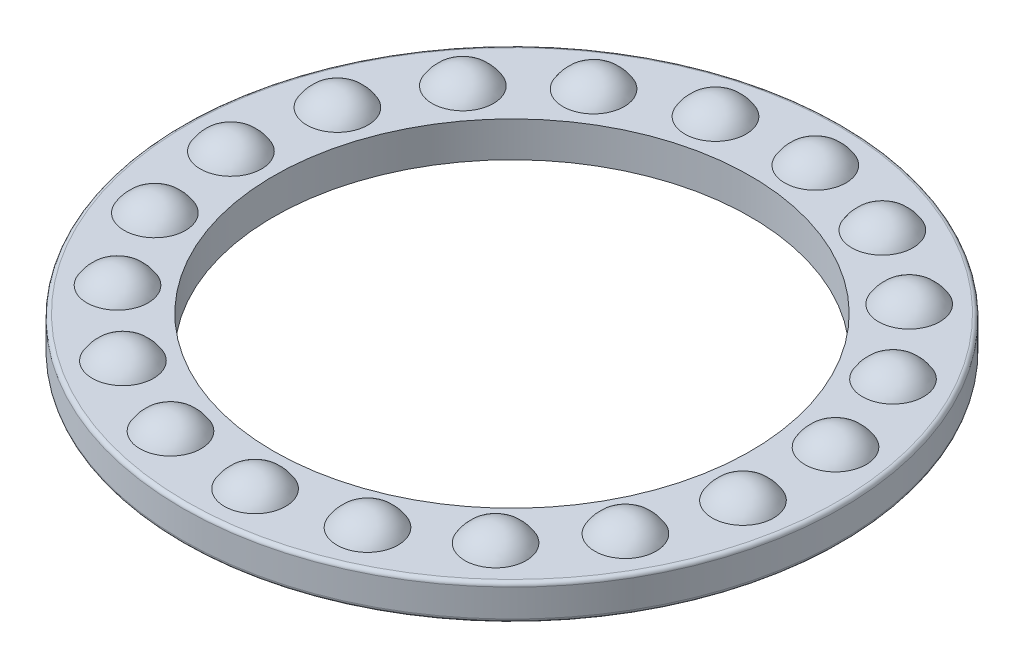
ISO-10303-21;
HEADER;
FILE_DESCRIPTION(('STEP AP214'),'2;1');
FILE_NAME('part.step','',(''),(''),'','','');
FILE_SCHEMA(('AUTOMOTIVE_DESIGN { 1 0 10303 214 1 1 1 1 }'));
ENDSEC;
DATA;
#1=APPLICATION_CONTEXT('core data for automotive mechanical design processes');
#2=APPLICATION_PROTOCOL_DEFINITION('international standard','automotive_design',2000,#1);
#3=PRODUCT_CONTEXT('',#1,'mechanical');
#4=PRODUCT('Part','Part','',(#3));
#5=PRODUCT_RELATED_PRODUCT_CATEGORY('part','',(#4));
#6=PRODUCT_DEFINITION_FORMATION('','',#4);
#7=PRODUCT_DEFINITION_CONTEXT('part definition',#1,'design');
#8=PRODUCT_DEFINITION('design','',#6,#7);
#9=PRODUCT_DEFINITION_SHAPE('','',#8);
#10=(LENGTH_UNIT() NAMED_UNIT(*) SI_UNIT(.MILLI.,.METRE.));
#11=(NAMED_UNIT(*) PLANE_ANGLE_UNIT() SI_UNIT($,.RADIAN.));
#12=(NAMED_UNIT(*) SI_UNIT($,.STERADIAN.) SOLID_ANGLE_UNIT());
#13=UNCERTAINTY_MEASURE_WITH_UNIT(LENGTH_MEASURE(1.E-05),#10,'distance_accuracy_value','');
#14=(GEOMETRIC_REPRESENTATION_CONTEXT(3) GLOBAL_UNCERTAINTY_ASSIGNED_CONTEXT((#13)) GLOBAL_UNIT_ASSIGNED_CONTEXT((#10,
#11,#12)) REPRESENTATION_CONTEXT('',''));
#15=CARTESIAN_POINT('',(0.,0.,0.));
#16=DIRECTION('',(0.,0.,1.));
#17=DIRECTION('',(1.,0.,0.));
#18=AXIS2_PLACEMENT_3D('',#15,#16,#17);
#19=CARTESIAN_POINT('',(0.,9.13,0.));
#20=DIRECTION('',(0.,1.,0.));
#21=DIRECTION('',(0.,0.,1.));
#22=AXIS2_PLACEMENT_3D('',#19,#20,#21);
#23=PLANE('',#22);
#24=CARTESIAN_POINT('',(-68.5717500232963,9.13,23.5407115173387));
#25=DIRECTION('',(0.,1.,0.));
#26=DIRECTION('',(0.,0.,1.));
#27=AXIS2_PLACEMENT_3D('',#24,#25,#26);
#28=CIRCLE('',#27,7.90681193655193);
#29=CARTESIAN_POINT('',(-68.5717500232963,9.13,31.4475234538906));
#30=VERTEX_POINT('',#29);
#31=EDGE_CURVE('E10',#30,#30,#28,.T.);
#32=ORIENTED_EDGE('',*,*,#31,.F.);
#33=EDGE_LOOP('',(#32));
#34=FACE_BOUND('',#33,.T.);
#35=CARTESIAN_POINT('',(-57.2126869312391,9.13,44.5304216700002));
#36=DIRECTION('',(0.,1.,0.));
#37=DIRECTION('',(0.,0.,1.));
#38=AXIS2_PLACEMENT_3D('',#35,#36,#37);
#39=CIRCLE('',#38,7.90681193655193);
#40=CARTESIAN_POINT('',(-57.2126869312391,9.13,52.4372336065521));
#41=VERTEX_POINT('',#40);
#42=EDGE_CURVE('E42',#41,#41,#39,.T.);
#43=ORIENTED_EDGE('',*,*,#42,.F.);
#44=EDGE_LOOP('',(#43));
#45=FACE_BOUND('',#44,.T.);
#46=CARTESIAN_POINT('',(-39.6537414638766,9.13,60.6945696740329));
#47=DIRECTION('',(0.,1.,0.));
#48=DIRECTION('',(0.,0.,1.));
#49=AXIS2_PLACEMENT_3D('',#46,#47,#48);
#50=CIRCLE('',#49,7.90681193655193);
#51=CARTESIAN_POINT('',(-39.6537414638766,9.13,68.6013816105848));
#52=VERTEX_POINT('',#51);
#53=EDGE_CURVE('E47',#52,#52,#50,.T.);
#54=ORIENTED_EDGE('',*,*,#53,.F.);
#55=EDGE_LOOP('',(#54));
#56=FACE_BOUND('',#55,.T.);
#57=CARTESIAN_POINT('',(-17.7976978177087,9.13,70.2815192806013));
#58=DIRECTION('',(0.,1.,0.));
#59=DIRECTION('',(0.,0.,1.));
#60=AXIS2_PLACEMENT_3D('',#57,#58,#59);
#61=CIRCLE('',#60,7.90681193655193);
#62=CARTESIAN_POINT('',(-17.7976978177087,9.13,78.1883312171532));
#63=VERTEX_POINT('',#62);
#64=EDGE_CURVE('E52',#63,#63,#61,.T.);
#65=ORIENTED_EDGE('',*,*,#64,.F.);
#66=EDGE_LOOP('',(#65));
#67=FACE_BOUND('',#66,.T.);
#68=CARTESIAN_POINT('',(5.98700254674342,9.13,72.2523757429836));
#69=DIRECTION('',(0.,1.,0.));
#70=DIRECTION('',(0.,0.,1.));
#71=AXIS2_PLACEMENT_3D('',#68,#69,#70);
#72=CIRCLE('',#71,7.90681193655193);
#73=CARTESIAN_POINT('',(5.98700254674342,9.13,80.1591876795355));
#74=VERTEX_POINT('',#73);
#75=EDGE_CURVE('E55',#74,#74,#72,.T.);
#76=ORIENTED_EDGE('',*,*,#75,.F.);
#77=EDGE_LOOP('',(#76));
#78=FACE_BOUND('',#77,.T.);
#79=CARTESIAN_POINT('',(29.1229182873397,9.13,66.3935661824919));
#80=DIRECTION('',(0.,1.,0.));
#81=DIRECTION('',(0.,0.,1.));
#82=AXIS2_PLACEMENT_3D('',#79,#80,#81);
#83=CIRCLE('',#82,7.90681193655193);
#84=CARTESIAN_POINT('',(29.1229182873397,9.13,74.3003781190439));
#85=VERTEX_POINT('',#84);
#86=EDGE_CURVE('E58',#85,#85,#83,.T.);
#87=ORIENTED_EDGE('',*,*,#86,.F.);
#88=EDGE_LOOP('',(#87));
#89=FACE_BOUND('',#88,.T.);
#90=CARTESIAN_POINT('',(49.1029139428658,9.13,53.3399835238025));
#91=DIRECTION('',(0.,1.,0.));
#92=DIRECTION('',(0.,0.,1.));
#93=AXIS2_PLACEMENT_3D('',#90,#91,#92);
#94=CIRCLE('',#93,7.90681193655193);
#95=CARTESIAN_POINT('',(49.1029139428658,9.13,61.2467954603544));
#96=VERTEX_POINT('',#95);
#97=EDGE_CURVE('E61',#96,#96,#94,.T.);
#98=ORIENTED_EDGE('',*,*,#97,.F.);
#99=EDGE_LOOP('',(#98));
#100=FACE_BOUND('',#99,.T.);
#101=CARTESIAN_POINT('',(63.7618469624702,9.13,34.5061859951883));
#102=DIRECTION('',(0.,1.,0.));
#103=DIRECTION('',(0.,0.,1.));
#104=AXIS2_PLACEMENT_3D('',#101,#102,#103);
#105=CIRCLE('',#104,7.90681193655193);
#106=CARTESIAN_POINT('',(63.7618469624702,9.13,42.4129979317402));
#107=VERTEX_POINT('',#106);
#108=EDGE_CURVE('E64',#107,#107,#105,.T.);
#109=ORIENTED_EDGE('',*,*,#108,.F.);
#110=EDGE_LOOP('',(#109));
#111=FACE_BOUND('',#110,.T.);
#112=CARTESIAN_POINT('',(71.5111944966973,9.13,11.9331077953537));
#113=DIRECTION('',(0.,1.,0.));
#114=DIRECTION('',(0.,0.,1.));
#115=AXIS2_PLACEMENT_3D('',#112,#113,#114);
#116=CIRCLE('',#115,7.90681193655193);
#117=CARTESIAN_POINT('',(71.5111944966973,9.13,19.8399197319056));
#118=VERTEX_POINT('',#117);
#119=EDGE_CURVE('E67',#118,#118,#116,.T.);
#120=ORIENTED_EDGE('',*,*,#119,.F.);
#121=EDGE_LOOP('',(#120));
#122=FACE_BOUND('',#121,.T.);
#123=CARTESIAN_POINT('',(71.5111944966974,9.13,-11.9331077953527));
#124=DIRECTION('',(0.,1.,0.));
#125=DIRECTION('',(0.,0.,1.));
#126=AXIS2_PLACEMENT_3D('',#123,#124,#125);
#127=CIRCLE('',#126,7.90681193655193);
#128=CARTESIAN_POINT('',(71.5111944966974,9.13,-4.02629585880081));
#129=VERTEX_POINT('',#128);
#130=EDGE_CURVE('E70',#129,#129,#127,.T.);
#131=ORIENTED_EDGE('',*,*,#130,.F.);
#132=EDGE_LOOP('',(#131));
#133=FACE_BOUND('',#132,.T.);
#134=CARTESIAN_POINT('',(63.7618469624706,9.13,-34.5061859951875));
#135=DIRECTION('',(0.,1.,0.));
#136=DIRECTION('',(0.,0.,1.));
#137=AXIS2_PLACEMENT_3D('',#134,#135,#136);
#138=CIRCLE('',#137,7.90681193655193);
#139=CARTESIAN_POINT('',(63.7618469624706,9.13,-26.5993740586356));
#140=VERTEX_POINT('',#139);
#141=EDGE_CURVE('E73',#140,#140,#138,.T.);
#142=ORIENTED_EDGE('',*,*,#141,.F.);
#143=EDGE_LOOP('',(#142));
#144=FACE_BOUND('',#143,.T.);
#145=CARTESIAN_POINT('',(49.1029139428665,9.13,-53.3399835238018));
#146=DIRECTION('',(0.,1.,0.));
#147=DIRECTION('',(0.,0.,1.));
#148=AXIS2_PLACEMENT_3D('',#145,#146,#147);
#149=CIRCLE('',#148,7.90681193655193);
#150=CARTESIAN_POINT('',(49.1029139428665,9.13,-45.4331715872499));
#151=VERTEX_POINT('',#150);
#152=EDGE_CURVE('E76',#151,#151,#149,.T.);
#153=ORIENTED_EDGE('',*,*,#152,.F.);
#154=EDGE_LOOP('',(#153));
#155=FACE_BOUND('',#154,.T.);
#156=CARTESIAN_POINT('',(29.1229182873406,9.13,-66.3935661824915));
#157=DIRECTION('',(0.,1.,0.));
#158=DIRECTION('',(0.,0.,1.));
#159=AXIS2_PLACEMENT_3D('',#156,#157,#158);
#160=CIRCLE('',#159,7.90681193655193);
#161=CARTESIAN_POINT('',(29.1229182873406,9.13,-58.4867542459396));
#162=VERTEX_POINT('',#161);
#163=EDGE_CURVE('E79',#162,#162,#160,.T.);
#164=ORIENTED_EDGE('',*,*,#163,.F.);
#165=EDGE_LOOP('',(#164));
#166=FACE_BOUND('',#165,.T.);
#167=CARTESIAN_POINT('',(5.98700254674435,9.13,-72.2523757429836));
#168=DIRECTION('',(0.,1.,0.));
#169=DIRECTION('',(0.,0.,1.));
#170=AXIS2_PLACEMENT_3D('',#167,#168,#169);
#171=CIRCLE('',#170,7.90681193655193);
#172=CARTESIAN_POINT('',(5.98700254674435,9.13,-64.3455638064316));
#173=VERTEX_POINT('',#172);
#174=EDGE_CURVE('E82',#173,#173,#171,.T.);
#175=ORIENTED_EDGE('',*,*,#174,.F.);
#176=EDGE_LOOP('',(#175));
#177=FACE_BOUND('',#176,.T.);
#178=CARTESIAN_POINT('',(-17.7976978177077,9.13,-70.2815192806015));
#179=DIRECTION('',(0.,1.,0.));
#180=DIRECTION('',(0.,0.,1.));
#181=AXIS2_PLACEMENT_3D('',#178,#179,#180);
#182=CIRCLE('',#181,7.90681193655193);
#183=CARTESIAN_POINT('',(-17.7976978177077,9.13,-62.3747073440496));
#184=VERTEX_POINT('',#183);
#185=EDGE_CURVE('E85',#184,#184,#182,.T.);
#186=ORIENTED_EDGE('',*,*,#185,.F.);
#187=EDGE_LOOP('',(#186));
#188=FACE_BOUND('',#187,.T.);
#189=CARTESIAN_POINT('',(-39.6537414638758,9.13,-60.6945696740334));
#190=DIRECTION('',(0.,1.,0.));
#191=DIRECTION('',(0.,0.,1.));
#192=AXIS2_PLACEMENT_3D('',#189,#190,#191);
#193=CIRCLE('',#192,7.90681193655193);
#194=CARTESIAN_POINT('',(-39.6537414638758,9.13,-52.7877577374815));
#195=VERTEX_POINT('',#194);
#196=EDGE_CURVE('E88',#195,#195,#193,.T.);
#197=ORIENTED_EDGE('',*,*,#196,.F.);
#198=EDGE_LOOP('',(#197));
#199=FACE_BOUND('',#198,.T.);
#200=CARTESIAN_POINT('',(-57.2126869312385,9.13,-44.530421670001));
#201=DIRECTION('',(0.,1.,0.));
#202=DIRECTION('',(0.,0.,1.));
#203=AXIS2_PLACEMENT_3D('',#200,#201,#202);
#204=CIRCLE('',#203,7.90681193655193);
#205=CARTESIAN_POINT('',(-57.2126869312385,9.13,-36.6236097334491));
#206=VERTEX_POINT('',#205);
#207=EDGE_CURVE('E91',#206,#206,#204,.T.);
#208=ORIENTED_EDGE('',*,*,#207,.F.);
#209=EDGE_LOOP('',(#208));
#210=FACE_BOUND('',#209,.T.);
#211=CARTESIAN_POINT('',(-68.571750023296,9.13,-23.5407115173396));
#212=DIRECTION('',(0.,1.,0.));
#213=DIRECTION('',(0.,0.,1.));
#214=AXIS2_PLACEMENT_3D('',#211,#212,#213);
#215=CIRCLE('',#214,7.90681193655193);
#216=CARTESIAN_POINT('',(-68.571750023296,9.13,-15.6338995807877));
#217=VERTEX_POINT('',#216);
#218=EDGE_CURVE('E94',#217,#217,#215,.T.);
#219=ORIENTED_EDGE('',*,*,#218,.F.);
#220=EDGE_LOOP('',(#219));
#221=FACE_BOUND('',#220,.T.);
#222=CARTESIAN_POINT('',(-72.5,9.13,0.));
#223=DIRECTION('',(0.,1.,0.));
#224=DIRECTION('',(0.,0.,1.));
#225=AXIS2_PLACEMENT_3D('',#222,#223,#224);
#226=CIRCLE('',#225,7.90681193655193);
#227=CARTESIAN_POINT('',(-72.5,9.13,7.90681193655193));
#228=VERTEX_POINT('',#227);
#229=EDGE_CURVE('E97',#228,#228,#226,.T.);
#230=ORIENTED_EDGE('',*,*,#229,.F.);
#231=EDGE_LOOP('',(#230));
#232=FACE_BOUND('',#231,.T.);
#233=CARTESIAN_POINT('',(0.,9.13,0.));
#234=DIRECTION('',(0.,1.,0.));
#235=DIRECTION('',(0.,0.,1.));
#236=AXIS2_PLACEMENT_3D('',#233,#234,#235);
#237=CIRCLE('',#236,84.);
#238=CARTESIAN_POINT('',(0.,9.13,84.));
#239=VERTEX_POINT('',#238);
#240=EDGE_CURVE('E100',#239,#239,#237,.T.);
#241=ORIENTED_EDGE('',*,*,#240,.T.);
#242=EDGE_LOOP('',(#241));
#243=FACE_BOUND('',#242,.T.);
#244=CARTESIAN_POINT('',(0.,9.13,0.));
#245=DIRECTION('',(0.,1.,0.));
#246=DIRECTION('',(0.,0.,1.));
#247=AXIS2_PLACEMENT_3D('',#244,#245,#246);
#248=CIRCLE('',#247,61.5);
#249=CARTESIAN_POINT('',(0.,9.13,61.5));
#250=VERTEX_POINT('',#249);
#251=EDGE_CURVE('E101',#250,#250,#248,.T.);
#252=ORIENTED_EDGE('',*,*,#251,.F.);
#253=EDGE_LOOP('',(#252));
#254=FACE_BOUND('',#253,.T.);
#255=ADVANCED_FACE('F34',(#34,#45,#56,#67,#78,#89,#100,#111,#122,#133,#144,#155,#166,#177,#188,
#199,#210,#221,#232,#243,#254),#23,.T.);
#256=CARTESIAN_POINT('',(0.,0.,0.));
#257=DIRECTION('',(0.,1.,0.));
#258=DIRECTION('',(0.,0.,1.));
#259=AXIS2_PLACEMENT_3D('',#256,#257,#258);
#260=PLANE('',#259);
#261=CARTESIAN_POINT('',(-68.5717500232963,0.,23.5407115173387));
#262=DIRECTION('',(0.,1.,0.));
#263=DIRECTION('',(0.,0.,1.));
#264=AXIS2_PLACEMENT_3D('',#261,#262,#263);
#265=CIRCLE('',#264,7.90681193655192);
#266=CARTESIAN_POINT('',(-68.5717500232963,0.,31.4475234538906));
#267=VERTEX_POINT('',#266);
#268=EDGE_CURVE('E38',#267,#267,#265,.T.);
#269=ORIENTED_EDGE('',*,*,#268,.T.);
#270=EDGE_LOOP('',(#269));
#271=FACE_BOUND('',#270,.T.);
#272=CARTESIAN_POINT('',(-57.2126869312391,0.,44.5304216700002));
#273=DIRECTION('',(0.,1.,0.));
#274=DIRECTION('',(0.,0.,1.));
#275=AXIS2_PLACEMENT_3D('',#272,#273,#274);
#276=CIRCLE('',#275,7.90681193655192);
#277=CARTESIAN_POINT('',(-57.2126869312391,0.,52.4372336065521));
#278=VERTEX_POINT('',#277);
#279=EDGE_CURVE('E168',#278,#278,#276,.T.);
#280=ORIENTED_EDGE('',*,*,#279,.T.);
#281=EDGE_LOOP('',(#280));
#282=FACE_BOUND('',#281,.T.);
#283=CARTESIAN_POINT('',(-39.6537414638766,0.,60.6945696740329));
#284=DIRECTION('',(0.,1.,0.));
#285=DIRECTION('',(0.,0.,1.));
#286=AXIS2_PLACEMENT_3D('',#283,#284,#285);
#287=CIRCLE('',#286,7.90681193655192);
#288=CARTESIAN_POINT('',(-39.6537414638766,0.,68.6013816105848));
#289=VERTEX_POINT('',#288);
#290=EDGE_CURVE('E166',#289,#289,#287,.T.);
#291=ORIENTED_EDGE('',*,*,#290,.T.);
#292=EDGE_LOOP('',(#291));
#293=FACE_BOUND('',#292,.T.);
#294=CARTESIAN_POINT('',(-17.7976978177087,0.,70.2815192806013));
#295=DIRECTION('',(0.,1.,0.));
#296=DIRECTION('',(0.,0.,1.));
#297=AXIS2_PLACEMENT_3D('',#294,#295,#296);
#298=CIRCLE('',#297,7.90681193655192);
#299=CARTESIAN_POINT('',(-17.7976978177087,0.,78.1883312171532));
#300=VERTEX_POINT('',#299);
#301=EDGE_CURVE('E163',#300,#300,#298,.T.);
#302=ORIENTED_EDGE('',*,*,#301,.T.);
#303=EDGE_LOOP('',(#302));
#304=FACE_BOUND('',#303,.T.);
#305=CARTESIAN_POINT('',(5.98700254674342,0.,72.2523757429836));
#306=DIRECTION('',(0.,1.,0.));
#307=DIRECTION('',(0.,0.,1.));
#308=AXIS2_PLACEMENT_3D('',#305,#306,#307);
#309=CIRCLE('',#308,7.90681193655192);
#310=CARTESIAN_POINT('',(5.98700254674342,0.,80.1591876795355));
#311=VERTEX_POINT('',#310);
#312=EDGE_CURVE('E160',#311,#311,#309,.T.);
#313=ORIENTED_EDGE('',*,*,#312,.T.);
#314=EDGE_LOOP('',(#313));
#315=FACE_BOUND('',#314,.T.);
#316=CARTESIAN_POINT('',(29.1229182873397,0.,66.3935661824919));
#317=DIRECTION('',(0.,1.,0.));
#318=DIRECTION('',(0.,0.,1.));
#319=AXIS2_PLACEMENT_3D('',#316,#317,#318);
#320=CIRCLE('',#319,7.90681193655192);
#321=CARTESIAN_POINT('',(29.1229182873397,0.,74.3003781190438));
#322=VERTEX_POINT('',#321);
#323=EDGE_CURVE('E157',#322,#322,#320,.T.);
#324=ORIENTED_EDGE('',*,*,#323,.T.);
#325=EDGE_LOOP('',(#324));
#326=FACE_BOUND('',#325,.T.);
#327=CARTESIAN_POINT('',(49.1029139428658,0.,53.3399835238025));
#328=DIRECTION('',(0.,1.,0.));
#329=DIRECTION('',(0.,0.,1.));
#330=AXIS2_PLACEMENT_3D('',#327,#328,#329);
#331=CIRCLE('',#330,7.90681193655192);
#332=CARTESIAN_POINT('',(49.1029139428658,0.,61.2467954603544));
#333=VERTEX_POINT('',#332);
#334=EDGE_CURVE('E154',#333,#333,#331,.T.);
#335=ORIENTED_EDGE('',*,*,#334,.T.);
#336=EDGE_LOOP('',(#335));
#337=FACE_BOUND('',#336,.T.);
#338=CARTESIAN_POINT('',(63.7618469624702,0.,34.5061859951883));
#339=DIRECTION('',(0.,1.,0.));
#340=DIRECTION('',(0.,0.,1.));
#341=AXIS2_PLACEMENT_3D('',#338,#339,#340);
#342=CIRCLE('',#341,7.90681193655192);
#343=CARTESIAN_POINT('',(63.7618469624702,0.,42.4129979317402));
#344=VERTEX_POINT('',#343);
#345=EDGE_CURVE('E151',#344,#344,#342,.T.);
#346=ORIENTED_EDGE('',*,*,#345,.T.);
#347=EDGE_LOOP('',(#346));
#348=FACE_BOUND('',#347,.T.);
#349=CARTESIAN_POINT('',(71.5111944966973,0.,11.9331077953537));
#350=DIRECTION('',(0.,1.,0.));
#351=DIRECTION('',(0.,0.,1.));
#352=AXIS2_PLACEMENT_3D('',#349,#350,#351);
#353=CIRCLE('',#352,7.90681193655192);
#354=CARTESIAN_POINT('',(71.5111944966973,0.,19.8399197319056));
#355=VERTEX_POINT('',#354);
#356=EDGE_CURVE('E148',#355,#355,#353,.T.);
#357=ORIENTED_EDGE('',*,*,#356,.T.);
#358=EDGE_LOOP('',(#357));
#359=FACE_BOUND('',#358,.T.);
#360=CARTESIAN_POINT('',(71.5111944966974,0.,-11.9331077953527));
#361=DIRECTION('',(0.,1.,0.));
#362=DIRECTION('',(0.,0.,1.));
#363=AXIS2_PLACEMENT_3D('',#360,#361,#362);
#364=CIRCLE('',#363,7.90681193655192);
#365=CARTESIAN_POINT('',(71.5111944966974,0.,-4.02629585880082));
#366=VERTEX_POINT('',#365);
#367=EDGE_CURVE('E145',#366,#366,#364,.T.);
#368=ORIENTED_EDGE('',*,*,#367,.T.);
#369=EDGE_LOOP('',(#368));
#370=FACE_BOUND('',#369,.T.);
#371=CARTESIAN_POINT('',(63.7618469624706,0.,-34.5061859951875));
#372=DIRECTION('',(0.,1.,0.));
#373=DIRECTION('',(0.,0.,1.));
#374=AXIS2_PLACEMENT_3D('',#371,#372,#373);
#375=CIRCLE('',#374,7.90681193655192);
#376=CARTESIAN_POINT('',(63.7618469624706,0.,-26.5993740586356));
#377=VERTEX_POINT('',#376);
#378=EDGE_CURVE('E142',#377,#377,#375,.T.);
#379=ORIENTED_EDGE('',*,*,#378,.T.);
#380=EDGE_LOOP('',(#379));
#381=FACE_BOUND('',#380,.T.);
#382=CARTESIAN_POINT('',(49.1029139428665,0.,-53.3399835238018));
#383=DIRECTION('',(0.,1.,0.));
#384=DIRECTION('',(0.,0.,1.));
#385=AXIS2_PLACEMENT_3D('',#382,#383,#384);
#386=CIRCLE('',#385,7.90681193655192);
#387=CARTESIAN_POINT('',(49.1029139428665,0.,-45.4331715872499));
#388=VERTEX_POINT('',#387);
#389=EDGE_CURVE('E139',#388,#388,#386,.T.);
#390=ORIENTED_EDGE('',*,*,#389,.T.);
#391=EDGE_LOOP('',(#390));
#392=FACE_BOUND('',#391,.T.);
#393=CARTESIAN_POINT('',(29.1229182873406,0.,-66.3935661824915));
#394=DIRECTION('',(0.,1.,0.));
#395=DIRECTION('',(0.,0.,1.));
#396=AXIS2_PLACEMENT_3D('',#393,#394,#395);
#397=CIRCLE('',#396,7.90681193655192);
#398=CARTESIAN_POINT('',(29.1229182873406,0.,-58.4867542459396));
#399=VERTEX_POINT('',#398);
#400=EDGE_CURVE('E136',#399,#399,#397,.T.);
#401=ORIENTED_EDGE('',*,*,#400,.T.);
#402=EDGE_LOOP('',(#401));
#403=FACE_BOUND('',#402,.T.);
#404=CARTESIAN_POINT('',(5.98700254674435,0.,-72.2523757429836));
#405=DIRECTION('',(0.,1.,0.));
#406=DIRECTION('',(0.,0.,1.));
#407=AXIS2_PLACEMENT_3D('',#404,#405,#406);
#408=CIRCLE('',#407,7.90681193655192);
#409=CARTESIAN_POINT('',(5.98700254674435,0.,-64.3455638064316));
#410=VERTEX_POINT('',#409);
#411=EDGE_CURVE('E133',#410,#410,#408,.T.);
#412=ORIENTED_EDGE('',*,*,#411,.T.);
#413=EDGE_LOOP('',(#412));
#414=FACE_BOUND('',#413,.T.);
#415=CARTESIAN_POINT('',(-17.7976978177077,0.,-70.2815192806015));
#416=DIRECTION('',(0.,1.,0.));
#417=DIRECTION('',(0.,0.,1.));
#418=AXIS2_PLACEMENT_3D('',#415,#416,#417);
#419=CIRCLE('',#418,7.90681193655192);
#420=CARTESIAN_POINT('',(-17.7976978177077,0.,-62.3747073440496));
#421=VERTEX_POINT('',#420);
#422=EDGE_CURVE('E130',#421,#421,#419,.T.);
#423=ORIENTED_EDGE('',*,*,#422,.T.);
#424=EDGE_LOOP('',(#423));
#425=FACE_BOUND('',#424,.T.);
#426=CARTESIAN_POINT('',(-39.6537414638758,0.,-60.6945696740334));
#427=DIRECTION('',(0.,1.,0.));
#428=DIRECTION('',(0.,0.,1.));
#429=AXIS2_PLACEMENT_3D('',#426,#427,#428);
#430=CIRCLE('',#429,7.90681193655192);
#431=CARTESIAN_POINT('',(-39.6537414638758,0.,-52.7877577374815));
#432=VERTEX_POINT('',#431);
#433=EDGE_CURVE('E127',#432,#432,#430,.T.);
#434=ORIENTED_EDGE('',*,*,#433,.T.);
#435=EDGE_LOOP('',(#434));
#436=FACE_BOUND('',#435,.T.);
#437=CARTESIAN_POINT('',(-57.2126869312385,0.,-44.530421670001));
#438=DIRECTION('',(0.,1.,0.));
#439=DIRECTION('',(0.,0.,1.));
#440=AXIS2_PLACEMENT_3D('',#437,#438,#439);
#441=CIRCLE('',#440,7.90681193655192);
#442=CARTESIAN_POINT('',(-57.2126869312385,0.,-36.6236097334491));
#443=VERTEX_POINT('',#442);
#444=EDGE_CURVE('E124',#443,#443,#441,.T.);
#445=ORIENTED_EDGE('',*,*,#444,.T.);
#446=EDGE_LOOP('',(#445));
#447=FACE_BOUND('',#446,.T.);
#448=CARTESIAN_POINT('',(-68.571750023296,0.,-23.5407115173396));
#449=DIRECTION('',(0.,1.,0.));
#450=DIRECTION('',(0.,0.,1.));
#451=AXIS2_PLACEMENT_3D('',#448,#449,#450);
#452=CIRCLE('',#451,7.90681193655192);
#453=CARTESIAN_POINT('',(-68.571750023296,0.,-15.6338995807877));
#454=VERTEX_POINT('',#453);
#455=EDGE_CURVE('E121',#454,#454,#452,.T.);
#456=ORIENTED_EDGE('',*,*,#455,.T.);
#457=EDGE_LOOP('',(#456));
#458=FACE_BOUND('',#457,.T.);
#459=CARTESIAN_POINT('',(-72.5,0.,0.));
#460=DIRECTION('',(0.,1.,0.));
#461=DIRECTION('',(0.,0.,1.));
#462=AXIS2_PLACEMENT_3D('',#459,#460,#461);
#463=CIRCLE('',#462,7.90681193655192);
#464=CARTESIAN_POINT('',(-72.5,0.,7.90681193655192));
#465=VERTEX_POINT('',#464);
#466=EDGE_CURVE('E108',#465,#465,#463,.T.);
#467=ORIENTED_EDGE('',*,*,#466,.T.);
#468=EDGE_LOOP('',(#467));
#469=FACE_BOUND('',#468,.T.);
#470=CARTESIAN_POINT('',(0.,0.,0.));
#471=DIRECTION('',(0.,1.,0.));
#472=DIRECTION('',(0.,0.,1.));
#473=AXIS2_PLACEMENT_3D('',#470,#471,#472);
#474=CIRCLE('',#473,84.);
#475=CARTESIAN_POINT('',(0.,0.,84.));
#476=VERTEX_POINT('',#475);
#477=EDGE_CURVE('E114',#476,#476,#474,.F.);
#478=ORIENTED_EDGE('',*,*,#477,.T.);
#479=EDGE_LOOP('',(#478));
#480=FACE_BOUND('',#479,.T.);
#481=CARTESIAN_POINT('',(0.,0.,0.));
#482=DIRECTION('',(0.,1.,0.));
#483=DIRECTION('',(0.,0.,1.));
#484=AXIS2_PLACEMENT_3D('',#481,#482,#483);
#485=CIRCLE('',#484,61.5);
#486=CARTESIAN_POINT('',(0.,0.,61.5));
#487=VERTEX_POINT('',#486);
#488=EDGE_CURVE('E105',#487,#487,#485,.T.);
#489=ORIENTED_EDGE('',*,*,#488,.T.);
#490=EDGE_LOOP('',(#489));
#491=FACE_BOUND('',#490,.T.);
#492=ADVANCED_FACE('F175',(#271,#282,#293,#304,#315,#326,#337,#348,#359,#370,#381,#392,#403,
#414,#425,#436,#447,#458,#469,#480,#491),#260,.F.);
#493=CARTESIAN_POINT('',(0.,9.13,0.));
#494=DIRECTION('',(0.,-1.,0.));
#495=DIRECTION('',(0.,0.,-1.));
#496=AXIS2_PLACEMENT_3D('',#493,#494,#495);
#497=CYLINDRICAL_SURFACE('',#496,85.);
#498=CARTESIAN_POINT('',(0.,0.999999999999999,0.));
#499=DIRECTION('',(0.,1.,0.));
#500=DIRECTION('',(0.,0.,1.));
#501=AXIS2_PLACEMENT_3D('',#498,#499,#500);
#502=CIRCLE('',#501,85.);
#503=CARTESIAN_POINT('',(0.,0.999999999999999,85.));
#504=VERTEX_POINT('',#503);
#505=EDGE_CURVE('E111',#504,#504,#502,.T.);
#506=ORIENTED_EDGE('',*,*,#505,.T.);
#507=EDGE_LOOP('',(#506));
#508=FACE_BOUND('',#507,.T.);
#509=CARTESIAN_POINT('',(0.,8.13,0.));
#510=DIRECTION('',(0.,1.,0.));
#511=DIRECTION('',(0.,0.,1.));
#512=AXIS2_PLACEMENT_3D('',#509,#510,#511);
#513=CIRCLE('',#512,85.);
#514=CARTESIAN_POINT('',(0.,8.13,85.));
#515=VERTEX_POINT('',#514);
#516=EDGE_CURVE('E104',#515,#515,#513,.F.);
#517=ORIENTED_EDGE('',*,*,#516,.T.);
#518=EDGE_LOOP('',(#517));
#519=FACE_BOUND('',#518,.T.);
#520=ADVANCED_FACE('F195',(#508,#519),#497,.T.);
#521=CARTESIAN_POINT('',(0.,9.13,0.));
#522=DIRECTION('',(0.,-1.,0.));
#523=DIRECTION('',(0.,0.,-1.));
#524=AXIS2_PLACEMENT_3D('',#521,#522,#523);
#525=CYLINDRICAL_SURFACE('',#524,61.5);
#526=ORIENTED_EDGE('',*,*,#251,.T.);
#527=EDGE_LOOP('',(#526));
#528=FACE_BOUND('',#527,.T.);
#529=ORIENTED_EDGE('',*,*,#488,.F.);
#530=EDGE_LOOP('',(#529));
#531=FACE_BOUND('',#530,.T.);
#532=ADVANCED_FACE('F199',(#528,#531),#525,.F.);
#533=CARTESIAN_POINT('',(0.,0.999999999999999,0.));
#534=DIRECTION('',(0.,1.,0.));
#535=DIRECTION('',(0.,0.,1.));
#536=AXIS2_PLACEMENT_3D('',#533,#534,#535);
#537=TOROIDAL_SURFACE('',#536,84.,1.);
#538=ORIENTED_EDGE('',*,*,#477,.F.);
#539=EDGE_LOOP('',(#538));
#540=FACE_BOUND('',#539,.T.);
#541=ORIENTED_EDGE('',*,*,#505,.F.);
#542=EDGE_LOOP('',(#541));
#543=FACE_BOUND('',#542,.T.);
#544=ADVANCED_FACE('F204',(#540,#543),#537,.T.);
#545=CARTESIAN_POINT('',(0.,8.13,0.));
#546=DIRECTION('',(0.,1.,0.));
#547=DIRECTION('',(0.,0.,1.));
#548=AXIS2_PLACEMENT_3D('',#545,#546,#547);
#549=TOROIDAL_SURFACE('',#548,84.,1.);
#550=ORIENTED_EDGE('',*,*,#516,.F.);
#551=EDGE_LOOP('',(#550));
#552=FACE_BOUND('',#551,.T.);
#553=ORIENTED_EDGE('',*,*,#240,.F.);
#554=EDGE_LOOP('',(#553));
#555=FACE_BOUND('',#554,.T.);
#556=ADVANCED_FACE('F36',(#552,#555),#549,.T.);
#557=CARTESIAN_POINT('',(-72.5,4.565,0.));
#558=DIRECTION('',(0.,-1.,0.));
#559=DIRECTION('',(-1.,0.,0.));
#560=AXIS2_PLACEMENT_3D('',#557,#558,#559);
#561=SPHERICAL_SURFACE('',#560,9.13);
#562=ORIENTED_EDGE('',*,*,#466,.F.);
#563=EDGE_LOOP('',(#562));
#564=FACE_BOUND('',#563,.T.);
#565=ADVANCED_FACE('F211',(#564),#561,.T.);
#566=ORIENTED_EDGE('',*,*,#229,.T.);
#567=EDGE_LOOP('',(#566));
#568=FACE_BOUND('',#567,.T.);
#569=ADVANCED_FACE('F253',(#568),#561,.T.);
#570=CARTESIAN_POINT('',(-68.571750023296,4.565,-23.5407115173396));
#571=DIRECTION('',(0.,-1.,0.));
#572=DIRECTION('',(-0.945817241700635,0.,-0.324699469204684));
#573=AXIS2_PLACEMENT_3D('',#570,#571,#572);
#574=SPHERICAL_SURFACE('',#573,9.13);
#575=ORIENTED_EDGE('',*,*,#455,.F.);
#576=EDGE_LOOP('',(#575));
#577=FACE_BOUND('',#576,.T.);
#578=ADVANCED_FACE('F246',(#577),#574,.T.);
#579=ORIENTED_EDGE('',*,*,#218,.T.);
#580=EDGE_LOOP('',(#579));
#581=FACE_BOUND('',#580,.T.);
#582=ADVANCED_FACE('F252',(#581),#574,.T.);
#583=CARTESIAN_POINT('',(-57.2126869312385,4.565,-44.530421670001));
#584=DIRECTION('',(0.,-1.,0.));
#585=DIRECTION('',(-0.789140509396393,0.,-0.614212712689669));
#586=AXIS2_PLACEMENT_3D('',#583,#584,#585);
#587=SPHERICAL_SURFACE('',#586,9.13);
#588=ORIENTED_EDGE('',*,*,#444,.F.);
#589=EDGE_LOOP('',(#588));
#590=FACE_BOUND('',#589,.T.);
#591=ADVANCED_FACE('F266',(#590),#587,.T.);
#592=ORIENTED_EDGE('',*,*,#207,.T.);
#593=EDGE_LOOP('',(#592));
#594=FACE_BOUND('',#593,.T.);
#595=ADVANCED_FACE('F276',(#594),#587,.T.);
#596=CARTESIAN_POINT('',(-39.6537414638758,4.565,-60.6945696740334));
#597=DIRECTION('',(0.,-1.,0.));
#598=DIRECTION('',(-0.546948158122425,0.,-0.83716647826253));
#599=AXIS2_PLACEMENT_3D('',#596,#597,#598);
#600=SPHERICAL_SURFACE('',#599,9.13);
#601=ORIENTED_EDGE('',*,*,#433,.F.);
#602=EDGE_LOOP('',(#601));
#603=FACE_BOUND('',#602,.T.);
#604=ADVANCED_FACE('F287',(#603),#600,.T.);
#605=ORIENTED_EDGE('',*,*,#196,.T.);
#606=EDGE_LOOP('',(#605));
#607=FACE_BOUND('',#606,.T.);
#608=ADVANCED_FACE('F297',(#607),#600,.T.);
#609=CARTESIAN_POINT('',(-17.7976978177077,4.565,-70.2815192806015));
#610=DIRECTION('',(0.,-1.,0.));
#611=DIRECTION('',(-0.245485487140796,0.,-0.969400265939331));
#612=AXIS2_PLACEMENT_3D('',#609,#610,#611);
#613=SPHERICAL_SURFACE('',#612,9.13);
#614=ORIENTED_EDGE('',*,*,#422,.F.);
#615=EDGE_LOOP('',(#614));
#616=FACE_BOUND('',#615,.T.);
#617=ADVANCED_FACE('F308',(#616),#613,.T.);
#618=ORIENTED_EDGE('',*,*,#185,.T.);
#619=EDGE_LOOP('',(#618));
#620=FACE_BOUND('',#619,.T.);
#621=ADVANCED_FACE('F318',(#620),#613,.T.);
#622=CARTESIAN_POINT('',(5.98700254674435,4.565,-72.2523757429836));
#623=DIRECTION('',(0.,-1.,0.));
#624=DIRECTION('',(0.0825793454723358,0.,-0.99658449300667));
#625=AXIS2_PLACEMENT_3D('',#622,#623,#624);
#626=SPHERICAL_SURFACE('',#625,9.13);
#627=ORIENTED_EDGE('',*,*,#411,.F.);
#628=EDGE_LOOP('',(#627));
#629=FACE_BOUND('',#628,.T.);
#630=ADVANCED_FACE('F329',(#629),#626,.T.);
#631=ORIENTED_EDGE('',*,*,#174,.T.);
#632=EDGE_LOOP('',(#631));
#633=FACE_BOUND('',#632,.T.);
#634=ADVANCED_FACE('F339',(#633),#626,.T.);
#635=CARTESIAN_POINT('',(29.1229182873406,4.565,-66.3935661824915));
#636=DIRECTION('',(0.,-1.,0.));
#637=DIRECTION('',(0.401695424652973,0.,-0.915773326655056));
#638=AXIS2_PLACEMENT_3D('',#635,#636,#637);
#639=SPHERICAL_SURFACE('',#638,9.13);
#640=ORIENTED_EDGE('',*,*,#400,.F.);
#641=EDGE_LOOP('',(#640));
#642=FACE_BOUND('',#641,.T.);
#643=ADVANCED_FACE('F350',(#642),#639,.T.);
#644=ORIENTED_EDGE('',*,*,#163,.T.);
#645=EDGE_LOOP('',(#644));
#646=FACE_BOUND('',#645,.T.);
#647=ADVANCED_FACE('F360',(#646),#639,.T.);
#648=CARTESIAN_POINT('',(49.1029139428665,4.565,-53.3399835238018));
#649=DIRECTION('',(0.,-1.,0.));
#650=DIRECTION('',(0.677281571625745,0.,-0.735723910673128));
#651=AXIS2_PLACEMENT_3D('',#648,#649,#650);
#652=SPHERICAL_SURFACE('',#651,9.13);
#653=ORIENTED_EDGE('',*,*,#389,.F.);
#654=EDGE_LOOP('',(#653));
#655=FACE_BOUND('',#654,.T.);
#656=ADVANCED_FACE('F371',(#655),#652,.T.);
#657=ORIENTED_EDGE('',*,*,#152,.T.);
#658=EDGE_LOOP('',(#657));
#659=FACE_BOUND('',#658,.T.);
#660=ADVANCED_FACE('F381',(#659),#652,.T.);
#661=CARTESIAN_POINT('',(63.7618469624706,4.565,-34.5061859951875));
#662=DIRECTION('',(0.,-1.,0.));
#663=DIRECTION('',(0.879473751206492,0.,-0.475947393037069));
#664=AXIS2_PLACEMENT_3D('',#661,#662,#663);
#665=SPHERICAL_SURFACE('',#664,9.13);
#666=ORIENTED_EDGE('',*,*,#378,.F.);
#667=EDGE_LOOP('',(#666));
#668=FACE_BOUND('',#667,.T.);
#669=ADVANCED_FACE('F392',(#668),#665,.T.);
#670=ORIENTED_EDGE('',*,*,#141,.T.);
#671=EDGE_LOOP('',(#670));
#672=FACE_BOUND('',#671,.T.);
#673=ADVANCED_FACE('F402',(#672),#665,.T.);
#674=CARTESIAN_POINT('',(71.5111944966974,4.565,-11.9331077953527));
#675=DIRECTION('',(0.,-1.,0.));
#676=DIRECTION('',(0.986361303402723,0.,-0.164594590280727));
#677=AXIS2_PLACEMENT_3D('',#674,#675,#676);
#678=SPHERICAL_SURFACE('',#677,9.13);
#679=ORIENTED_EDGE('',*,*,#367,.F.);
#680=EDGE_LOOP('',(#679));
#681=FACE_BOUND('',#680,.T.);
#682=ADVANCED_FACE('F413',(#681),#678,.T.);
#683=ORIENTED_EDGE('',*,*,#130,.T.);
#684=EDGE_LOOP('',(#683));
#685=FACE_BOUND('',#684,.T.);
#686=ADVANCED_FACE('F423',(#685),#678,.T.);
#687=CARTESIAN_POINT('',(71.5111944966973,4.565,11.9331077953537));
#688=DIRECTION('',(0.,-1.,0.));
#689=DIRECTION('',(0.986361303402721,0.,0.164594590280741));
#690=AXIS2_PLACEMENT_3D('',#687,#688,#689);
#691=SPHERICAL_SURFACE('',#690,9.13);
#692=ORIENTED_EDGE('',*,*,#356,.F.);
#693=EDGE_LOOP('',(#692));
#694=FACE_BOUND('',#693,.T.);
#695=ADVANCED_FACE('F434',(#694),#691,.T.);
#696=ORIENTED_EDGE('',*,*,#119,.T.);
#697=EDGE_LOOP('',(#696));
#698=FACE_BOUND('',#697,.T.);
#699=ADVANCED_FACE('F444',(#698),#691,.T.);
#700=CARTESIAN_POINT('',(63.7618469624702,4.565,34.5061859951883));
#701=DIRECTION('',(0.,-1.,0.));
#702=DIRECTION('',(0.879473751206486,0.,0.47594739303708));
#703=AXIS2_PLACEMENT_3D('',#700,#701,#702);
#704=SPHERICAL_SURFACE('',#703,9.13);
#705=ORIENTED_EDGE('',*,*,#345,.F.);
#706=EDGE_LOOP('',(#705));
#707=FACE_BOUND('',#706,.T.);
#708=ADVANCED_FACE('F455',(#707),#704,.T.);
#709=ORIENTED_EDGE('',*,*,#108,.T.);
#710=EDGE_LOOP('',(#709));
#711=FACE_BOUND('',#710,.T.);
#712=ADVANCED_FACE('F465',(#711),#704,.T.);
#713=CARTESIAN_POINT('',(49.1029139428658,4.565,53.3399835238025));
#714=DIRECTION('',(0.,-1.,0.));
#715=DIRECTION('',(0.677281571625735,0.,0.735723910673137));
#716=AXIS2_PLACEMENT_3D('',#713,#714,#715);
#717=SPHERICAL_SURFACE('',#716,9.13);
#718=ORIENTED_EDGE('',*,*,#334,.F.);
#719=EDGE_LOOP('',(#718));
#720=FACE_BOUND('',#719,.T.);
#721=ADVANCED_FACE('F476',(#720),#717,.T.);
#722=ORIENTED_EDGE('',*,*,#97,.T.);
#723=EDGE_LOOP('',(#722));
#724=FACE_BOUND('',#723,.T.);
#725=ADVANCED_FACE('F486',(#724),#717,.T.);
#726=CARTESIAN_POINT('',(29.1229182873397,4.565,66.3935661824919));
#727=DIRECTION('',(0.,-1.,0.));
#728=DIRECTION('',(0.401695424652961,0.,0.915773326655061));
#729=AXIS2_PLACEMENT_3D('',#726,#727,#728);
#730=SPHERICAL_SURFACE('',#729,9.13);
#731=ORIENTED_EDGE('',*,*,#323,.F.);
#732=EDGE_LOOP('',(#731));
#733=FACE_BOUND('',#732,.T.);
#734=ADVANCED_FACE('F497',(#733),#730,.T.);
#735=ORIENTED_EDGE('',*,*,#86,.T.);
#736=EDGE_LOOP('',(#735));
#737=FACE_BOUND('',#736,.T.);
#738=ADVANCED_FACE('F507',(#737),#730,.T.);
#739=CARTESIAN_POINT('',(5.98700254674342,4.565,72.2523757429836));
#740=DIRECTION('',(0.,-1.,0.));
#741=DIRECTION('',(0.082579345472323,0.,0.996584493006671));
#742=AXIS2_PLACEMENT_3D('',#739,#740,#741);
#743=SPHERICAL_SURFACE('',#742,9.13);
#744=ORIENTED_EDGE('',*,*,#312,.F.);
#745=EDGE_LOOP('',(#744));
#746=FACE_BOUND('',#745,.T.);
#747=ADVANCED_FACE('F518',(#746),#743,.T.);
#748=ORIENTED_EDGE('',*,*,#75,.T.);
#749=EDGE_LOOP('',(#748));
#750=FACE_BOUND('',#749,.T.);
#751=ADVANCED_FACE('F528',(#750),#743,.T.);
#752=CARTESIAN_POINT('',(-17.7976978177087,4.565,70.2815192806013));
#753=DIRECTION('',(0.,-1.,0.));
#754=DIRECTION('',(-0.245485487140809,0.,0.969400265939328));
#755=AXIS2_PLACEMENT_3D('',#752,#753,#754);
#756=SPHERICAL_SURFACE('',#755,9.13);
#757=ORIENTED_EDGE('',*,*,#301,.F.);
#758=EDGE_LOOP('',(#757));
#759=FACE_BOUND('',#758,.T.);
#760=ADVANCED_FACE('F539',(#759),#756,.T.);
#761=ORIENTED_EDGE('',*,*,#64,.T.);
#762=EDGE_LOOP('',(#761));
#763=FACE_BOUND('',#762,.T.);
#764=ADVANCED_FACE('F549',(#763),#756,.T.);
#765=CARTESIAN_POINT('',(-39.6537414638766,4.565,60.6945696740329));
#766=DIRECTION('',(0.,-1.,0.));
#767=DIRECTION('',(-0.546948158122436,0.,0.837166478262522));
#768=AXIS2_PLACEMENT_3D('',#765,#766,#767);
#769=SPHERICAL_SURFACE('',#768,9.13);
#770=ORIENTED_EDGE('',*,*,#290,.F.);
#771=EDGE_LOOP('',(#770));
#772=FACE_BOUND('',#771,.T.);
#773=ADVANCED_FACE('F560',(#772),#769,.T.);
#774=ORIENTED_EDGE('',*,*,#53,.T.);
#775=EDGE_LOOP('',(#774));
#776=FACE_BOUND('',#775,.T.);
#777=ADVANCED_FACE('F570',(#776),#769,.T.);
#778=CARTESIAN_POINT('',(-57.2126869312391,4.565,44.5304216700002));
#779=DIRECTION('',(0.,-1.,0.));
#780=DIRECTION('',(-0.789140509396401,0.,0.614212712689658));
#781=AXIS2_PLACEMENT_3D('',#778,#779,#780);
#782=SPHERICAL_SURFACE('',#781,9.13);
#783=ORIENTED_EDGE('',*,*,#279,.F.);
#784=EDGE_LOOP('',(#783));
#785=FACE_BOUND('',#784,.T.);
#786=ADVANCED_FACE('F186',(#785),#782,.T.);
#787=ORIENTED_EDGE('',*,*,#42,.T.);
#788=EDGE_LOOP('',(#787));
#789=FACE_BOUND('',#788,.T.);
#790=ADVANCED_FACE('F180',(#789),#782,.T.);
#791=CARTESIAN_POINT('',(-68.5717500232963,4.565,23.5407115173387));
#792=DIRECTION('',(0.,-1.,0.));
#793=DIRECTION('',(-0.945817241700639,0.,0.324699469204671));
#794=AXIS2_PLACEMENT_3D('',#791,#792,#793);
#795=SPHERICAL_SURFACE('',#794,9.13);
#796=ORIENTED_EDGE('',*,*,#268,.F.);
#797=EDGE_LOOP('',(#796));
#798=FACE_BOUND('',#797,.T.);
#799=ADVANCED_FACE('F177',(#798),#795,.T.);
#800=ORIENTED_EDGE('',*,*,#31,.T.);
#801=EDGE_LOOP('',(#800));
#802=FACE_BOUND('',#801,.T.);
#803=ADVANCED_FACE('F179',(#802),#795,.T.);
#804=CLOSED_SHELL('',(#255,#492,#520,#532,#544,#556,#565,#569,#578,#582,#591,#595,#604,#608,
#617,#621,#630,#634,#643,#647,#656,#660,#669,#673,#682,#686,#695,#699,#708,#712,#721,#725,#734,
#738,#747,#751,#760,#764,#773,#777,#786,#790,#799,#803));
#805=MANIFOLD_SOLID_BREP('B2',#804);
#806=ADVANCED_BREP_SHAPE_REPRESENTATION('',(#18,#805),#14);
#807=SHAPE_DEFINITION_REPRESENTATION(#9,#806);
ENDSEC;
END-ISO-10303-21;
